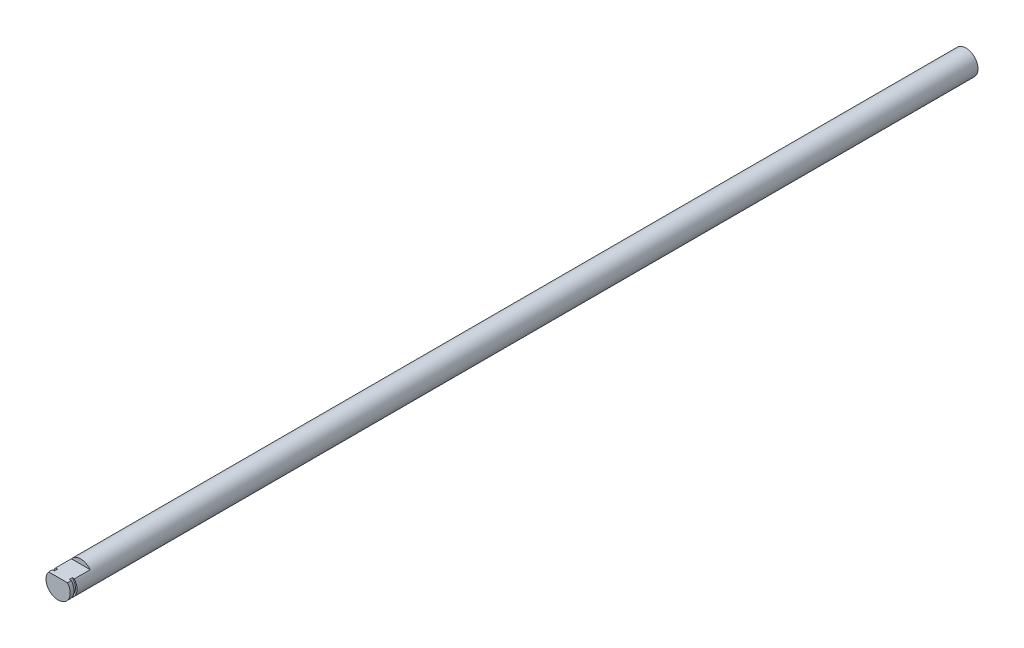
ISO-10303-21;
HEADER;
FILE_DESCRIPTION(('STEP AP214'),'2;1');
FILE_NAME('part.step','',(''),(''),'','','');
FILE_SCHEMA(('AUTOMOTIVE_DESIGN { 1 0 10303 214 1 1 1 1 }'));
ENDSEC;
DATA;
#1=APPLICATION_CONTEXT('core data for automotive mechanical design processes');
#2=APPLICATION_PROTOCOL_DEFINITION('international standard','automotive_design',2000,#1);
#3=PRODUCT_CONTEXT('',#1,'mechanical');
#4=PRODUCT('Part','Part','',(#3));
#5=PRODUCT_RELATED_PRODUCT_CATEGORY('part','',(#4));
#6=PRODUCT_DEFINITION_FORMATION('','',#4);
#7=PRODUCT_DEFINITION_CONTEXT('part definition',#1,'design');
#8=PRODUCT_DEFINITION('design','',#6,#7);
#9=PRODUCT_DEFINITION_SHAPE('','',#8);
#10=(LENGTH_UNIT() NAMED_UNIT(*) SI_UNIT(.MILLI.,.METRE.));
#11=(NAMED_UNIT(*) PLANE_ANGLE_UNIT() SI_UNIT($,.RADIAN.));
#12=(NAMED_UNIT(*) SI_UNIT($,.STERADIAN.) SOLID_ANGLE_UNIT());
#13=UNCERTAINTY_MEASURE_WITH_UNIT(LENGTH_MEASURE(1.E-05),#10,'distance_accuracy_value','');
#14=(GEOMETRIC_REPRESENTATION_CONTEXT(3) GLOBAL_UNCERTAINTY_ASSIGNED_CONTEXT((#13)) GLOBAL_UNIT_ASSIGNED_CONTEXT((#10,
#11,#12)) REPRESENTATION_CONTEXT('',''));
#15=CARTESIAN_POINT('',(0.,0.,0.));
#16=DIRECTION('',(0.,0.,1.));
#17=DIRECTION('',(1.,0.,0.));
#18=AXIS2_PLACEMENT_3D('',#15,#16,#17);
#19=CARTESIAN_POINT('',(0.,0.,325.));
#20=DIRECTION('',(0.,0.,-1.));
#21=DIRECTION('',(-1.,0.,0.));
#22=AXIS2_PLACEMENT_3D('',#19,#20,#21);
#23=CYLINDRICAL_SURFACE('',#22,4.);
#24=CARTESIAN_POINT('',(0.,0.,322.75));
#25=DIRECTION('',(0.,0.,1.));
#26=DIRECTION('',(1.,0.,0.));
#27=AXIS2_PLACEMENT_3D('',#24,#25,#26);
#28=CIRCLE('',#27,4.);
#29=CARTESIAN_POINT('',(-3.1224989991992,2.5,322.75));
#30=VERTEX_POINT('',#29);
#31=CARTESIAN_POINT('',(3.1224989991992,2.5,322.75));
#32=VERTEX_POINT('',#31);
#33=EDGE_CURVE('E111',#30,#32,#28,.T.);
#34=ORIENTED_EDGE('',*,*,#33,.F.);
#35=DIRECTION('',(0.,0.,1.));
#36=VECTOR('',#35,1.);
#37=CARTESIAN_POINT('',(-3.1224989991992,2.5,317.5));
#38=LINE('',#37,#36);
#39=CARTESIAN_POINT('',(-3.1224989991992,2.5,317.5));
#40=VERTEX_POINT('',#39);
#41=EDGE_CURVE('E130',#40,#30,#38,.T.);
#42=ORIENTED_EDGE('',*,*,#41,.F.);
#43=CARTESIAN_POINT('',(0.,0.,317.5));
#44=DIRECTION('',(0.,0.,1.));
#45=DIRECTION('',(1.,0.,0.));
#46=AXIS2_PLACEMENT_3D('',#43,#44,#45);
#47=CIRCLE('',#46,4.);
#48=CARTESIAN_POINT('',(3.1224989991992,2.5,317.5));
#49=VERTEX_POINT('',#48);
#50=EDGE_CURVE('E137',#49,#40,#47,.T.);
#51=ORIENTED_EDGE('',*,*,#50,.F.);
#52=DIRECTION('',(0.,0.,1.));
#53=VECTOR('',#52,1.);
#54=CARTESIAN_POINT('',(3.1224989991992,2.5,317.5));
#55=LINE('',#54,#53);
#56=EDGE_CURVE('E129',#49,#32,#55,.T.);
#57=ORIENTED_EDGE('',*,*,#56,.T.);
#58=EDGE_LOOP('',(#34,#42,#51,#57));
#59=FACE_BOUND('',#58,.T.);
#60=CARTESIAN_POINT('',(0.,0.,25.));
#61=DIRECTION('',(0.,0.,-1.));
#62=DIRECTION('',(-1.,0.,0.));
#63=AXIS2_PLACEMENT_3D('',#60,#61,#62);
#64=CIRCLE('',#63,4.);
#65=CARTESIAN_POINT('',(-4.,0.,25.));
#66=VERTEX_POINT('',#65);
#67=EDGE_CURVE('E145',#66,#66,#64,.T.);
#68=ORIENTED_EDGE('',*,*,#67,.F.);
#69=EDGE_LOOP('',(#68));
#70=FACE_BOUND('',#69,.T.);
#71=ADVANCED_FACE('F50',(#59,#70),#23,.T.);
#72=CARTESIAN_POINT('',(3.1224989991992,2.5,317.5));
#73=DIRECTION('',(0.,-1.,0.));
#74=DIRECTION('',(0.,0.,-1.));
#75=AXIS2_PLACEMENT_3D('',#72,#73,#74);
#76=PLANE('',#75);
#77=DIRECTION('',(-1.,0.,0.));
#78=VECTOR('',#77,1.);
#79=CARTESIAN_POINT('',(3.1224989991992,2.5,322.75));
#80=LINE('',#79,#78);
#81=CARTESIAN_POINT('',(2.44948974278318,2.5,322.75));
#82=VERTEX_POINT('',#81);
#83=EDGE_CURVE('E13',#32,#82,#80,.T.);
#84=ORIENTED_EDGE('',*,*,#83,.F.);
#85=ORIENTED_EDGE('',*,*,#56,.F.);
#86=DIRECTION('',(1.,0.,0.));
#87=VECTOR('',#86,1.);
#88=CARTESIAN_POINT('',(3.1224989991992,2.5,317.5));
#89=LINE('',#88,#87);
#90=EDGE_CURVE('E138',#40,#49,#89,.T.);
#91=ORIENTED_EDGE('',*,*,#90,.F.);
#92=ORIENTED_EDGE('',*,*,#41,.T.);
#93=CARTESIAN_POINT('',(-2.44948974278318,2.5,322.75));
#94=VERTEX_POINT('',#93);
#95=EDGE_CURVE('E60',#94,#30,#80,.T.);
#96=ORIENTED_EDGE('',*,*,#95,.F.);
#97=DIRECTION('',(0.,0.,1.));
#98=VECTOR('',#97,1.);
#99=CARTESIAN_POINT('',(-2.44948974278318,2.5,322.75));
#100=LINE('',#99,#98);
#101=CARTESIAN_POINT('',(-2.44948974278318,2.5,323.75));
#102=VERTEX_POINT('',#101);
#103=EDGE_CURVE('E116',#102,#94,#100,.F.);
#104=ORIENTED_EDGE('',*,*,#103,.F.);
#105=DIRECTION('',(-1.,0.,0.));
#106=VECTOR('',#105,1.);
#107=CARTESIAN_POINT('',(3.1224989991992,2.5,323.75));
#108=LINE('',#107,#106);
#109=CARTESIAN_POINT('',(-3.1224989991992,2.5,323.75));
#110=VERTEX_POINT('',#109);
#111=EDGE_CURVE('E123',#102,#110,#108,.T.);
#112=ORIENTED_EDGE('',*,*,#111,.T.);
#113=CARTESIAN_POINT('',(-3.1224989991992,2.5,325.));
#114=VERTEX_POINT('',#113);
#115=EDGE_CURVE('E75',#110,#114,#38,.T.);
#116=ORIENTED_EDGE('',*,*,#115,.T.);
#117=DIRECTION('',(1.,0.,0.));
#118=VECTOR('',#117,1.);
#119=CARTESIAN_POINT('',(3.1224989991992,2.5,325.));
#120=LINE('',#119,#118);
#121=CARTESIAN_POINT('',(3.1224989991992,2.5,325.));
#122=VERTEX_POINT('',#121);
#123=EDGE_CURVE('E135',#114,#122,#120,.T.);
#124=ORIENTED_EDGE('',*,*,#123,.T.);
#125=CARTESIAN_POINT('',(3.1224989991992,2.5,323.75));
#126=VERTEX_POINT('',#125);
#127=EDGE_CURVE('E133',#126,#122,#55,.T.);
#128=ORIENTED_EDGE('',*,*,#127,.F.);
#129=CARTESIAN_POINT('',(2.44948974278318,2.5,323.75));
#130=VERTEX_POINT('',#129);
#131=EDGE_CURVE('E59',#126,#130,#108,.T.);
#132=ORIENTED_EDGE('',*,*,#131,.T.);
#133=DIRECTION('',(0.,0.,1.));
#134=VECTOR('',#133,1.);
#135=CARTESIAN_POINT('',(2.44948974278318,2.5,322.75));
#136=LINE('',#135,#134);
#137=EDGE_CURVE('E54',#82,#130,#136,.T.);
#138=ORIENTED_EDGE('',*,*,#137,.F.);
#139=EDGE_LOOP('',(#84,#85,#91,#92,#96,#104,#112,#116,#124,#128,#132,#138));
#140=FACE_BOUND('',#139,.T.);
#141=ADVANCED_FACE('F120',(#140),#76,.F.);
#142=ORIENTED_EDGE('',*,*,#115,.F.);
#143=CARTESIAN_POINT('',(0.,0.,323.75));
#144=DIRECTION('',(0.,0.,1.));
#145=DIRECTION('',(1.,0.,0.));
#146=AXIS2_PLACEMENT_3D('',#143,#144,#145);
#147=CIRCLE('',#146,4.);
#148=EDGE_CURVE('E117',#110,#126,#147,.T.);
#149=ORIENTED_EDGE('',*,*,#148,.T.);
#150=ORIENTED_EDGE('',*,*,#127,.T.);
#151=CARTESIAN_POINT('',(0.,0.,325.));
#152=DIRECTION('',(0.,0.,1.));
#153=DIRECTION('',(1.,0.,0.));
#154=AXIS2_PLACEMENT_3D('',#151,#152,#153);
#155=CIRCLE('',#154,4.);
#156=EDGE_CURVE('E126',#114,#122,#155,.T.);
#157=ORIENTED_EDGE('',*,*,#156,.F.);
#158=EDGE_LOOP('',(#142,#149,#150,#157));
#159=FACE_BOUND('',#158,.T.);
#160=ADVANCED_FACE('F52',(#159),#23,.T.);
#161=CARTESIAN_POINT('',(0.,0.,325.));
#162=DIRECTION('',(0.,0.,1.));
#163=DIRECTION('',(1.,0.,0.));
#164=AXIS2_PLACEMENT_3D('',#161,#162,#163);
#165=PLANE('',#164);
#166=ORIENTED_EDGE('',*,*,#123,.F.);
#167=ORIENTED_EDGE('',*,*,#156,.T.);
#168=EDGE_LOOP('',(#166,#167));
#169=FACE_BOUND('',#168,.T.);
#170=ADVANCED_FACE('F159',(#169),#165,.T.);
#171=CARTESIAN_POINT('',(0.,0.,317.5));
#172=DIRECTION('',(0.,0.,1.));
#173=DIRECTION('',(1.,0.,0.));
#174=AXIS2_PLACEMENT_3D('',#171,#172,#173);
#175=PLANE('',#174);
#176=ORIENTED_EDGE('',*,*,#50,.T.);
#177=ORIENTED_EDGE('',*,*,#90,.T.);
#178=EDGE_LOOP('',(#176,#177));
#179=FACE_BOUND('',#178,.T.);
#180=ADVANCED_FACE('F164',(#179),#175,.T.);
#181=CARTESIAN_POINT('',(0.,0.,322.75));
#182=DIRECTION('',(0.,0.,1.));
#183=DIRECTION('',(1.,0.,0.));
#184=AXIS2_PLACEMENT_3D('',#181,#182,#183);
#185=PLANE('',#184);
#186=ORIENTED_EDGE('',*,*,#83,.T.);
#187=CARTESIAN_POINT('',(0.,0.,322.75));
#188=DIRECTION('',(0.,0.,1.));
#189=DIRECTION('',(1.,0.,0.));
#190=AXIS2_PLACEMENT_3D('',#187,#188,#189);
#191=CIRCLE('',#190,3.5);
#192=EDGE_CURVE('E108',#94,#82,#191,.T.);
#193=ORIENTED_EDGE('',*,*,#192,.F.);
#194=ORIENTED_EDGE('',*,*,#95,.T.);
#195=ORIENTED_EDGE('',*,*,#33,.T.);
#196=EDGE_LOOP('',(#186,#193,#194,#195));
#197=FACE_BOUND('',#196,.T.);
#198=ADVANCED_FACE('F107',(#197),#185,.T.);
#199=CARTESIAN_POINT('',(0.,0.,323.75));
#200=DIRECTION('',(0.,0.,1.));
#201=DIRECTION('',(1.,0.,0.));
#202=AXIS2_PLACEMENT_3D('',#199,#200,#201);
#203=PLANE('',#202);
#204=ORIENTED_EDGE('',*,*,#148,.F.);
#205=ORIENTED_EDGE('',*,*,#111,.F.);
#206=CARTESIAN_POINT('',(0.,0.,323.75));
#207=DIRECTION('',(0.,0.,1.));
#208=DIRECTION('',(1.,0.,0.));
#209=AXIS2_PLACEMENT_3D('',#206,#207,#208);
#210=CIRCLE('',#209,3.5);
#211=EDGE_CURVE('E67',#102,#130,#210,.T.);
#212=ORIENTED_EDGE('',*,*,#211,.T.);
#213=ORIENTED_EDGE('',*,*,#131,.F.);
#214=EDGE_LOOP('',(#204,#205,#212,#213));
#215=FACE_BOUND('',#214,.T.);
#216=ADVANCED_FACE('F168',(#215),#203,.F.);
#217=CARTESIAN_POINT('',(0.,0.,322.75));
#218=DIRECTION('',(0.,0.,1.));
#219=DIRECTION('',(1.,0.,0.));
#220=AXIS2_PLACEMENT_3D('',#217,#218,#219);
#221=CYLINDRICAL_SURFACE('',#220,3.5);
#222=ORIENTED_EDGE('',*,*,#137,.T.);
#223=ORIENTED_EDGE('',*,*,#211,.F.);
#224=ORIENTED_EDGE('',*,*,#103,.T.);
#225=ORIENTED_EDGE('',*,*,#192,.T.);
#226=EDGE_LOOP('',(#222,#223,#224,#225));
#227=FACE_BOUND('',#226,.T.);
#228=ADVANCED_FACE('F114',(#227),#221,.T.);
#229=CARTESIAN_POINT('',(0.,0.,25.));
#230=DIRECTION('',(0.,0.,-1.));
#231=DIRECTION('',(-1.,0.,0.));
#232=AXIS2_PLACEMENT_3D('',#229,#230,#231);
#233=PLANE('',#232);
#234=ORIENTED_EDGE('',*,*,#67,.T.);
#235=EDGE_LOOP('',(#234));
#236=FACE_BOUND('',#235,.T.);
#237=ADVANCED_FACE('F150',(#236),#233,.T.);
#238=CLOSED_SHELL('',(#71,#141,#160,#170,#180,#198,#216,#228,#237));
#239=MANIFOLD_SOLID_BREP('B2',#238);
#240=ADVANCED_BREP_SHAPE_REPRESENTATION('',(#18,#239),#14);
#241=SHAPE_DEFINITION_REPRESENTATION(#9,#240);
ENDSEC;
END-ISO-10303-21;
